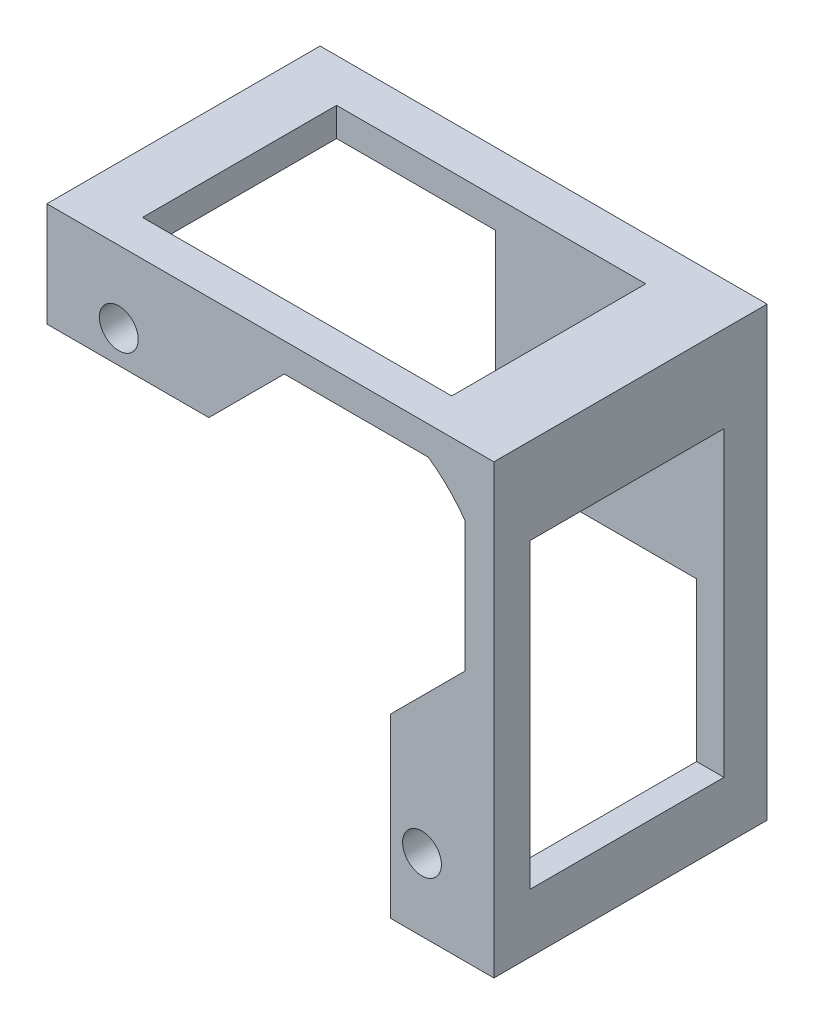
ISO-10303-21;
HEADER;
FILE_DESCRIPTION(('STEP AP214'),'2;1');
FILE_NAME('part.step','',(''),(''),'','','');
FILE_SCHEMA(('AUTOMOTIVE_DESIGN { 1 0 10303 214 1 1 1 1 }'));
ENDSEC;
DATA;
#1=APPLICATION_CONTEXT('core data for automotive mechanical design processes');
#2=APPLICATION_PROTOCOL_DEFINITION('international standard','automotive_design',2000,#1);
#3=PRODUCT_CONTEXT('',#1,'mechanical');
#4=PRODUCT('Part','Part','',(#3));
#5=PRODUCT_RELATED_PRODUCT_CATEGORY('part','',(#4));
#6=PRODUCT_DEFINITION_FORMATION('','',#4);
#7=PRODUCT_DEFINITION_CONTEXT('part definition',#1,'design');
#8=PRODUCT_DEFINITION('design','',#6,#7);
#9=PRODUCT_DEFINITION_SHAPE('','',#8);
#10=(LENGTH_UNIT() NAMED_UNIT(*) SI_UNIT(.MILLI.,.METRE.));
#11=(NAMED_UNIT(*) PLANE_ANGLE_UNIT() SI_UNIT($,.RADIAN.));
#12=(NAMED_UNIT(*) SI_UNIT($,.STERADIAN.) SOLID_ANGLE_UNIT());
#13=UNCERTAINTY_MEASURE_WITH_UNIT(LENGTH_MEASURE(1.E-05),#10,'distance_accuracy_value','');
#14=(GEOMETRIC_REPRESENTATION_CONTEXT(3) GLOBAL_UNCERTAINTY_ASSIGNED_CONTEXT((#13)) GLOBAL_UNIT_ASSIGNED_CONTEXT((#10,
#11,#12)) REPRESENTATION_CONTEXT('',''));
#15=CARTESIAN_POINT('',(0.,0.,0.));
#16=DIRECTION('',(0.,0.,1.));
#17=DIRECTION('',(1.,0.,0.));
#18=AXIS2_PLACEMENT_3D('',#15,#16,#17);
#19=CARTESIAN_POINT('',(117.830929329769,164.974596583901,-421.));
#20=DIRECTION('',(0.,0.,1.));
#21=DIRECTION('',(0.,-1.,0.));
#22=AXIS2_PLACEMENT_3D('',#19,#20,#21);
#23=CYLINDRICAL_SURFACE('',#22,2.7);
#24=CARTESIAN_POINT('',(117.830929329769,164.974596583901,-421.));
#25=DIRECTION('',(0.,0.,1.));
#26=DIRECTION('',(0.,-1.,0.));
#27=AXIS2_PLACEMENT_3D('',#24,#25,#26);
#28=CIRCLE('',#27,2.7);
#29=CARTESIAN_POINT('',(117.830929329769,167.674596583901,-421.));
#30=VERTEX_POINT('',#29);
#31=EDGE_CURVE('E362',#30,#30,#28,.T.);
#32=ORIENTED_EDGE('',*,*,#31,.F.);
#33=DIRECTION('',(0.,0.,1.));
#34=VECTOR('',#33,1.);
#35=CARTESIAN_POINT('',(117.830929329769,167.674596583901,-421.));
#36=LINE('',#35,#34);
#37=CARTESIAN_POINT('',(117.830929329769,167.674596583901,-416.));
#38=VERTEX_POINT('',#37);
#39=EDGE_CURVE('E11',#30,#38,#36,.T.);
#40=ORIENTED_EDGE('',*,*,#39,.T.);
#41=CARTESIAN_POINT('',(117.830929329769,164.974596583901,-416.));
#42=DIRECTION('',(0.,0.,-1.));
#43=DIRECTION('',(0.,-1.,0.));
#44=AXIS2_PLACEMENT_3D('',#41,#42,#43);
#45=CIRCLE('',#44,2.7);
#46=EDGE_CURVE('E532',#38,#38,#45,.T.);
#47=ORIENTED_EDGE('',*,*,#46,.F.);
#48=ORIENTED_EDGE('',*,*,#39,.F.);
#49=EDGE_LOOP('',(#32,#40,#47,#48));
#50=FACE_BOUND('',#49,.T.);
#51=ADVANCED_FACE('F16',(#50),#23,.F.);
#52=CARTESIAN_POINT('',(159.999969673495,122.805556240176,-421.));
#53=DIRECTION('',(0.,0.,1.));
#54=DIRECTION('',(0.,-1.,0.));
#55=AXIS2_PLACEMENT_3D('',#52,#53,#54);
#56=CYLINDRICAL_SURFACE('',#55,2.7);
#57=CARTESIAN_POINT('',(159.999969673495,122.805556240176,-421.));
#58=DIRECTION('',(0.,0.,1.));
#59=DIRECTION('',(0.,-1.,0.));
#60=AXIS2_PLACEMENT_3D('',#57,#58,#59);
#61=CIRCLE('',#60,2.7);
#62=CARTESIAN_POINT('',(159.999969673495,125.505556240176,-421.));
#63=VERTEX_POINT('',#62);
#64=EDGE_CURVE('E336',#63,#63,#61,.T.);
#65=ORIENTED_EDGE('',*,*,#64,.F.);
#66=DIRECTION('',(0.,0.,1.));
#67=VECTOR('',#66,1.);
#68=CARTESIAN_POINT('',(159.999969673495,125.505556240176,-421.));
#69=LINE('',#68,#67);
#70=CARTESIAN_POINT('',(159.999969673495,125.505556240176,-416.));
#71=VERTEX_POINT('',#70);
#72=EDGE_CURVE('E27',#63,#71,#69,.T.);
#73=ORIENTED_EDGE('',*,*,#72,.T.);
#74=CARTESIAN_POINT('',(159.999969673495,122.805556240176,-416.));
#75=DIRECTION('',(0.,0.,-1.));
#76=DIRECTION('',(0.,-1.,0.));
#77=AXIS2_PLACEMENT_3D('',#74,#75,#76);
#78=CIRCLE('',#77,2.7);
#79=EDGE_CURVE('E446',#71,#71,#78,.T.);
#80=ORIENTED_EDGE('',*,*,#79,.F.);
#81=ORIENTED_EDGE('',*,*,#72,.F.);
#82=EDGE_LOOP('',(#65,#73,#80,#81));
#83=FACE_BOUND('',#82,.T.);
#84=ADVANCED_FACE('F657',(#83),#56,.F.);
#85=CARTESIAN_POINT('',(143.062672238361,138.974597314058,-421.));
#86=DIRECTION('',(0.,0.,-1.));
#87=DIRECTION('',(0.,-1.,0.));
#88=AXIS2_PLACEMENT_3D('',#85,#86,#87);
#89=PLANE('',#88);
#90=ORIENTED_EDGE('',*,*,#31,.T.);
#91=EDGE_LOOP('',(#90));
#92=FACE_BOUND('',#91,.T.);
#93=DIRECTION('',(1.,0.,0.));
#94=VECTOR('',#93,1.);
#95=CARTESIAN_POINT('',(135.711309430854,160.478931824688,-421.));
#96=LINE('',#95,#94);
#97=CARTESIAN_POINT('',(107.830929329769,160.478931824688,-421.));
#98=VERTEX_POINT('',#97);
#99=CARTESIAN_POINT('',(130.354281864133,160.478931824688,-421.));
#100=VERTEX_POINT('',#99);
#101=EDGE_CURVE('E369',#98,#100,#96,.T.);
#102=ORIENTED_EDGE('',*,*,#101,.F.);
#103=DIRECTION('',(0.,1.,0.));
#104=VECTOR('',#103,1.);
#105=CARTESIAN_POINT('',(107.830929329769,154.974596583901,-421.));
#106=LINE('',#105,#104);
#107=CARTESIAN_POINT('',(107.830929329769,170.974596583901,-421.));
#108=VERTEX_POINT('',#107);
#109=EDGE_CURVE('E358',#98,#108,#106,.T.);
#110=ORIENTED_EDGE('',*,*,#109,.T.);
#111=DIRECTION('',(-1.,0.,0.));
#112=VECTOR('',#111,1.);
#113=CARTESIAN_POINT('',(125.446800784065,170.974596583901,-421.));
#114=LINE('',#113,#112);
#115=CARTESIAN_POINT('',(116.125374803227,170.974596583901,-421.000004917383));
#116=VERTEX_POINT('',#115);
#117=EDGE_CURVE('E461',#116,#108,#114,.T.);
#118=ORIENTED_EDGE('',*,*,#117,.F.);
#119=DIRECTION('',(0.,1.,0.));
#120=VECTOR('',#119,1.);
#121=CARTESIAN_POINT('',(116.125374803227,174.974596583901,-421.000004917383));
#122=LINE('',#121,#120);
#123=CARTESIAN_POINT('',(116.125374803227,174.974596583901,-421.000004917383));
#124=VERTEX_POINT('',#123);
#125=EDGE_CURVE('E428',#116,#124,#122,.T.);
#126=ORIENTED_EDGE('',*,*,#125,.T.);
#127=DIRECTION('',(1.,0.,0.));
#128=VECTOR('',#127,1.);
#129=CARTESIAN_POINT('',(116.125374803227,174.974596583901,-421.000004917383));
#130=LINE('',#129,#128);
#131=CARTESIAN_POINT('',(159.125375443977,174.974596583901,-421.000004917383));
#132=VERTEX_POINT('',#131);
#133=EDGE_CURVE('E357',#124,#132,#130,.T.);
#134=ORIENTED_EDGE('',*,*,#133,.T.);
#135=DIRECTION('',(0.,-1.,0.));
#136=VECTOR('',#135,1.);
#137=CARTESIAN_POINT('',(159.125375443977,174.974596583901,-421.000004917383));
#138=LINE('',#137,#136);
#139=CARTESIAN_POINT('',(159.125375443977,172.083609871223,-421.000004917383));
#140=VERTEX_POINT('',#139);
#141=EDGE_CURVE('E213',#132,#140,#138,.T.);
#142=ORIENTED_EDGE('',*,*,#141,.T.);
#143=CARTESIAN_POINT('',(148.821478068075,153.796104978481,-421.));
#144=DIRECTION('',(0.,0.,-1.));
#145=DIRECTION('',(0.,-1.,0.));
#146=AXIS2_PLACEMENT_3D('',#143,#144,#145);
#147=CIRCLE('',#146,20.9905487383057);
#148=CARTESIAN_POINT('',(160.88392236837,170.974596583901,-421.));
#149=VERTEX_POINT('',#148);
#150=EDGE_CURVE('E399',#140,#149,#147,.T.);
#151=ORIENTED_EDGE('',*,*,#150,.T.);
#152=DIRECTION('',(1.,0.,0.));
#153=VECTOR('',#152,1.);
#154=CARTESIAN_POINT('',(107.830929329769,170.974596583901,-421.));
#155=LINE('',#154,#153);
#156=CARTESIAN_POINT('',(140.849946623346,170.974596583901,-421.));
#157=VERTEX_POINT('',#156);
#158=EDGE_CURVE('E363',#157,#149,#155,.T.);
#159=ORIENTED_EDGE('',*,*,#158,.F.);
#160=DIRECTION('',(-0.707106781186547,-0.707106781186548,0.));
#161=VECTOR('',#160,1.);
#162=CARTESIAN_POINT('',(130.280628209639,160.405278170194,-421.));
#163=LINE('',#162,#161);
#164=EDGE_CURVE('E356',#157,#100,#163,.T.);
#165=ORIENTED_EDGE('',*,*,#164,.T.);
#166=EDGE_LOOP('',(#102,#110,#118,#126,#134,#142,#151,#159,#165));
#167=FACE_BOUND('',#166,.T.);
#168=ADVANCED_FACE('F662',(#92,#167),#89,.T.);
#169=CARTESIAN_POINT('',(107.830929329769,174.974596583901,-421.));
#170=DIRECTION('',(-1.,0.,0.));
#171=DIRECTION('',(0.,0.,1.));
#172=AXIS2_PLACEMENT_3D('',#169,#170,#171);
#173=PLANE('',#172);
#174=ORIENTED_EDGE('',*,*,#109,.F.);
#175=DIRECTION('',(0.,0.,1.));
#176=VECTOR('',#175,1.);
#177=CARTESIAN_POINT('',(107.830929329769,160.478931824688,-418.5));
#178=LINE('',#177,#176);
#179=CARTESIAN_POINT('',(107.830929329769,160.478931824688,-416.));
#180=VERTEX_POINT('',#179);
#181=EDGE_CURVE('E372',#98,#180,#178,.T.);
#182=ORIENTED_EDGE('',*,*,#181,.T.);
#183=DIRECTION('',(0.,-1.,0.));
#184=VECTOR('',#183,1.);
#185=CARTESIAN_POINT('',(107.830929329769,160.978931824688,-416.));
#186=LINE('',#185,#184);
#187=CARTESIAN_POINT('',(107.830929329769,174.974596583901,-416.));
#188=VERTEX_POINT('',#187);
#189=EDGE_CURVE('E309',#188,#180,#186,.T.);
#190=ORIENTED_EDGE('',*,*,#189,.F.);
#191=DIRECTION('',(0.,0.,1.));
#192=VECTOR('',#191,1.);
#193=CARTESIAN_POINT('',(107.830929329769,174.974596583901,-418.5));
#194=LINE('',#193,#192);
#195=CARTESIAN_POINT('',(107.830929329769,174.974596583901,-454.));
#196=VERTEX_POINT('',#195);
#197=EDGE_CURVE('E325',#196,#188,#194,.T.);
#198=ORIENTED_EDGE('',*,*,#197,.F.);
#199=DIRECTION('',(0.,-1.,0.));
#200=VECTOR('',#199,1.);
#201=CARTESIAN_POINT('',(107.830929329769,174.974596583901,-454.));
#202=LINE('',#201,#200);
#203=CARTESIAN_POINT('',(107.830929329769,170.974596583901,-454.));
#204=VERTEX_POINT('',#203);
#205=EDGE_CURVE('E337',#196,#204,#202,.T.);
#206=ORIENTED_EDGE('',*,*,#205,.T.);
#207=DIRECTION('',(0.,0.,-1.));
#208=VECTOR('',#207,1.);
#209=CARTESIAN_POINT('',(107.830929329769,170.974596583901,-421.));
#210=LINE('',#209,#208);
#211=EDGE_CURVE('E465',#108,#204,#210,.T.);
#212=ORIENTED_EDGE('',*,*,#211,.F.);
#213=EDGE_LOOP('',(#174,#182,#190,#198,#206,#212));
#214=FACE_BOUND('',#213,.T.);
#215=ADVANCED_FACE('F667',(#214),#173,.T.);
#216=CARTESIAN_POINT('',(165.999969673495,132.934964665105,-416.));
#217=DIRECTION('',(-1.,0.,0.));
#218=DIRECTION('',(0.,0.,1.));
#219=AXIS2_PLACEMENT_3D('',#216,#217,#218);
#220=PLANE('',#219);
#221=DIRECTION('',(0.,0.,1.));
#222=VECTOR('',#221,1.);
#223=CARTESIAN_POINT('',(165.999969673495,147.784964665105,-416.));
#224=LINE('',#223,#222);
#225=CARTESIAN_POINT('',(165.999969673495,147.784964665105,-421.));
#226=VERTEX_POINT('',#225);
#227=CARTESIAN_POINT('',(165.999969673495,147.784964665105,-416.));
#228=VERTEX_POINT('',#227);
#229=EDGE_CURVE('E547',#226,#228,#224,.T.);
#230=ORIENTED_EDGE('',*,*,#229,.T.);
#231=DIRECTION('',(0.,1.,0.));
#232=VECTOR('',#231,1.);
#233=CARTESIAN_POINT('',(165.999969673495,112.805556240176,-416.));
#234=LINE('',#233,#232);
#235=CARTESIAN_POINT('',(165.999969673495,165.858549278776,-416.));
#236=VERTEX_POINT('',#235);
#237=EDGE_CURVE('E346',#228,#236,#234,.T.);
#238=ORIENTED_EDGE('',*,*,#237,.T.);
#239=DIRECTION('',(0.,0.,-1.));
#240=VECTOR('',#239,1.);
#241=CARTESIAN_POINT('',(165.999969673495,165.858549278776,-454.));
#242=LINE('',#241,#240);
#243=CARTESIAN_POINT('',(165.999969673495,165.858549278776,-421.));
#244=VERTEX_POINT('',#243);
#245=EDGE_CURVE('E364',#236,#244,#242,.T.);
#246=ORIENTED_EDGE('',*,*,#245,.T.);
#247=DIRECTION('',(0.,-1.,0.));
#248=VECTOR('',#247,1.);
#249=CARTESIAN_POINT('',(165.999969673495,135.954780989581,-421.));
#250=LINE('',#249,#248);
#251=EDGE_CURVE('E331',#244,#226,#250,.T.);
#252=ORIENTED_EDGE('',*,*,#251,.T.);
#253=EDGE_LOOP('',(#230,#238,#246,#252));
#254=FACE_BOUND('',#253,.T.);
#255=ADVANCED_FACE('F626',(#254),#220,.T.);
#256=CARTESIAN_POINT('',(169.999969673495,120.974598312436,-425.000004902482));
#257=DIRECTION('',(0.,1.,0.));
#258=DIRECTION('',(1.,0.,0.));
#259=AXIS2_PLACEMENT_3D('',#256,#257,#258);
#260=PLANE('',#259);
#261=DIRECTION('',(1.,0.,0.));
#262=VECTOR('',#261,1.);
#263=CARTESIAN_POINT('',(159.410723870785,120.974598312436,-448.));
#264=LINE('',#263,#262);
#265=CARTESIAN_POINT('',(166.196900933288,120.974598312436,-448.000005155802));
#266=VERTEX_POINT('',#265);
#267=CARTESIAN_POINT('',(169.999969673495,120.974598312436,-448.000005155802));
#268=VERTEX_POINT('',#267);
#269=EDGE_CURVE('E392',#266,#268,#264,.T.);
#270=ORIENTED_EDGE('',*,*,#269,.F.);
#271=DIRECTION('',(0.,0.,1.));
#272=VECTOR('',#271,1.);
#273=CARTESIAN_POINT('',(166.196900933288,120.974598312436,-431.500002577901));
#274=LINE('',#273,#272);
#275=CARTESIAN_POINT('',(166.196900933288,120.974598312436,-421.000004902482));
#276=VERTEX_POINT('',#275);
#277=EDGE_CURVE('E434',#266,#276,#274,.T.);
#278=ORIENTED_EDGE('',*,*,#277,.T.);
#279=DIRECTION('',(-1.,0.,0.));
#280=VECTOR('',#279,1.);
#281=CARTESIAN_POINT('',(169.999969673495,120.974598312436,-421.000004902482));
#282=LINE('',#281,#280);
#283=CARTESIAN_POINT('',(169.999969673495,120.974598312436,-421.000004902482));
#284=VERTEX_POINT('',#283);
#285=EDGE_CURVE('E352',#284,#276,#282,.T.);
#286=ORIENTED_EDGE('',*,*,#285,.F.);
#287=DIRECTION('',(0.,0.,-1.));
#288=VECTOR('',#287,1.);
#289=CARTESIAN_POINT('',(169.999969673495,120.974598312436,-429.000002577901));
#290=LINE('',#289,#288);
#291=EDGE_CURVE('E514',#284,#268,#290,.T.);
#292=ORIENTED_EDGE('',*,*,#291,.T.);
#293=EDGE_LOOP('',(#270,#278,#286,#292));
#294=FACE_BOUND('',#293,.T.);
#295=ADVANCED_FACE('F1015',(#294),#260,.T.);
#296=CARTESIAN_POINT('',(107.830929329769,170.974596583901,-421.));
#297=DIRECTION('',(0.,1.,0.));
#298=DIRECTION('',(1.,0.,0.));
#299=AXIS2_PLACEMENT_3D('',#296,#297,#298);
#300=PLANE('',#299);
#301=DIRECTION('',(0.,0.,-1.));
#302=VECTOR('',#301,1.);
#303=CARTESIAN_POINT('',(140.849946623346,170.974596583901,-418.5));
#304=LINE('',#303,#302);
#305=CARTESIAN_POINT('',(140.849946623346,170.974596583901,-416.));
#306=VERTEX_POINT('',#305);
#307=EDGE_CURVE('E373',#306,#157,#304,.T.);
#308=ORIENTED_EDGE('',*,*,#307,.T.);
#309=ORIENTED_EDGE('',*,*,#158,.T.);
#310=DIRECTION('',(0.,0.,1.));
#311=VECTOR('',#310,1.);
#312=CARTESIAN_POINT('',(160.88392236837,170.974596583901,-454.));
#313=LINE('',#312,#311);
#314=CARTESIAN_POINT('',(160.88392236837,170.974596583901,-416.));
#315=VERTEX_POINT('',#314);
#316=EDGE_CURVE('E368',#149,#315,#313,.T.);
#317=ORIENTED_EDGE('',*,*,#316,.T.);
#318=DIRECTION('',(1.,0.,0.));
#319=VECTOR('',#318,1.);
#320=CARTESIAN_POINT('',(107.830929329769,170.974596583901,-416.));
#321=LINE('',#320,#319);
#322=EDGE_CURVE('E347',#306,#315,#321,.T.);
#323=ORIENTED_EDGE('',*,*,#322,.F.);
#324=EDGE_LOOP('',(#308,#309,#317,#323));
#325=FACE_BOUND('',#324,.T.);
#326=ADVANCED_FACE('F956',(#325),#300,.F.);
#327=CARTESIAN_POINT('',(158.574969673495,140.359964665105,-416.));
#328=DIRECTION('',(0.707106781186547,-0.707106781186548,0.));
#329=DIRECTION('',(0.,0.,-1.));
#330=AXIS2_PLACEMENT_3D('',#327,#328,#329);
#331=PLANE('',#330);
#332=DIRECTION('',(0.,0.,-1.));
#333=VECTOR('',#332,1.);
#334=CARTESIAN_POINT('',(155.648699836796,137.433694828406,-418.5));
#335=LINE('',#334,#333);
#336=CARTESIAN_POINT('',(155.648699836796,137.433694828406,-416.));
#337=VERTEX_POINT('',#336);
#338=CARTESIAN_POINT('',(155.648699836796,137.433694828406,-421.));
#339=VERTEX_POINT('',#338);
#340=EDGE_CURVE('E335',#337,#339,#335,.T.);
#341=ORIENTED_EDGE('',*,*,#340,.F.);
#342=DIRECTION('',(-0.707106781186548,-0.707106781186547,0.));
#343=VECTOR('',#342,1.);
#344=CARTESIAN_POINT('',(154.35055347695,136.13554846856,-416.));
#345=LINE('',#344,#343);
#346=EDGE_CURVE('E316',#228,#337,#345,.T.);
#347=ORIENTED_EDGE('',*,*,#346,.F.);
#348=ORIENTED_EDGE('',*,*,#229,.F.);
#349=DIRECTION('',(0.707106781186548,0.707106781186547,0.));
#350=VECTOR('',#349,1.);
#351=CARTESIAN_POINT('',(154.35055347695,136.13554846856,-421.));
#352=LINE('',#351,#350);
#353=EDGE_CURVE('E480',#339,#226,#352,.T.);
#354=ORIENTED_EDGE('',*,*,#353,.F.);
#355=EDGE_LOOP('',(#341,#347,#348,#354));
#356=FACE_BOUND('',#355,.T.);
#357=ADVANCED_FACE('F617',(#356),#331,.F.);
#358=CARTESIAN_POINT('',(169.999969673495,174.974596583901,-416.));
#359=DIRECTION('',(1.,0.,0.));
#360=DIRECTION('',(0.,-1.,0.));
#361=AXIS2_PLACEMENT_3D('',#358,#359,#360);
#362=PLANE('',#361);
#363=ORIENTED_EDGE('',*,*,#291,.F.);
#364=DIRECTION('',(0.,-1.,0.));
#365=VECTOR('',#364,1.);
#366=CARTESIAN_POINT('',(169.999969673495,168.974597761093,-421.000004902482));
#367=LINE('',#366,#365);
#368=CARTESIAN_POINT('',(169.999969673495,162.974598938285,-421.000004902482));
#369=VERTEX_POINT('',#368);
#370=EDGE_CURVE('E348',#369,#284,#367,.T.);
#371=ORIENTED_EDGE('',*,*,#370,.F.);
#372=DIRECTION('',(0.,0.,1.));
#373=VECTOR('',#372,1.);
#374=CARTESIAN_POINT('',(169.999969673495,162.974598938285,-429.000002577901));
#375=LINE('',#374,#373);
#376=CARTESIAN_POINT('',(169.999969673495,162.974598938285,-448.000005155802));
#377=VERTEX_POINT('',#376);
#378=EDGE_CURVE('E429',#377,#369,#375,.T.);
#379=ORIENTED_EDGE('',*,*,#378,.F.);
#380=DIRECTION('',(0.,-1.,0.));
#381=VECTOR('',#380,1.);
#382=CARTESIAN_POINT('',(169.999969673495,147.974597448168,-448.000005155802));
#383=LINE('',#382,#381);
#384=EDGE_CURVE('E396',#377,#268,#383,.T.);
#385=ORIENTED_EDGE('',*,*,#384,.T.);
#386=EDGE_LOOP('',(#363,#371,#379,#385));
#387=FACE_BOUND('',#386,.T.);
#388=DIRECTION('',(0.,1.,0.));
#389=VECTOR('',#388,1.);
#390=CARTESIAN_POINT('',(169.999969673495,112.805556240176,-454.));
#391=LINE('',#390,#389);
#392=CARTESIAN_POINT('',(169.999969673495,112.805556240176,-454.));
#393=VERTEX_POINT('',#392);
#394=CARTESIAN_POINT('',(169.999969673495,174.974596583901,-454.));
#395=VERTEX_POINT('',#394);
#396=EDGE_CURVE('E418',#393,#395,#391,.T.);
#397=ORIENTED_EDGE('',*,*,#396,.T.);
#398=DIRECTION('',(0.,0.,-1.));
#399=VECTOR('',#398,1.);
#400=CARTESIAN_POINT('',(169.999969673495,174.974596583901,-416.));
#401=LINE('',#400,#399);
#402=CARTESIAN_POINT('',(169.999969673495,174.974596583901,-416.));
#403=VERTEX_POINT('',#402);
#404=EDGE_CURVE('E321',#403,#395,#401,.T.);
#405=ORIENTED_EDGE('',*,*,#404,.F.);
#406=DIRECTION('',(0.,-1.,0.));
#407=VECTOR('',#406,1.);
#408=CARTESIAN_POINT('',(169.999969673495,174.974596583901,-416.));
#409=LINE('',#408,#407);
#410=CARTESIAN_POINT('',(169.999969673495,112.805556240176,-416.));
#411=VERTEX_POINT('',#410);
#412=EDGE_CURVE('E407',#403,#411,#409,.T.);
#413=ORIENTED_EDGE('',*,*,#412,.T.);
#414=DIRECTION('',(0.,0.,-1.));
#415=VECTOR('',#414,1.);
#416=CARTESIAN_POINT('',(169.999969673495,112.805556240176,-418.5));
#417=LINE('',#416,#415);
#418=EDGE_CURVE('E439',#411,#393,#417,.T.);
#419=ORIENTED_EDGE('',*,*,#418,.T.);
#420=EDGE_LOOP('',(#397,#405,#413,#419));
#421=FACE_BOUND('',#420,.T.);
#422=ADVANCED_FACE('F18',(#387,#421),#362,.T.);
#423=CARTESIAN_POINT('',(116.125374803227,174.974596583901,-443.000005170703));
#424=DIRECTION('',(1.,0.,0.));
#425=DIRECTION('',(0.,-1.,0.));
#426=AXIS2_PLACEMENT_3D('',#423,#424,#425);
#427=PLANE('',#426);
#428=DIRECTION('',(0.,-1.,0.));
#429=VECTOR('',#428,1.);
#430=CARTESIAN_POINT('',(116.125374803227,164.385350781191,-448.));
#431=LINE('',#430,#429);
#432=CARTESIAN_POINT('',(116.125374803227,174.974596583901,-448.000005170703));
#433=VERTEX_POINT('',#432);
#434=CARTESIAN_POINT('',(116.125374803227,170.974596583901,-448.000005170703));
#435=VERTEX_POINT('',#434);
#436=EDGE_CURVE('E507',#433,#435,#431,.T.);
#437=ORIENTED_EDGE('',*,*,#436,.F.);
#438=DIRECTION('',(0.,0.,1.));
#439=VECTOR('',#438,1.);
#440=CARTESIAN_POINT('',(116.125374803227,174.974596583901,-421.000002458692));
#441=LINE('',#440,#439);
#442=EDGE_CURVE('E324',#433,#124,#441,.T.);
#443=ORIENTED_EDGE('',*,*,#442,.T.);
#444=ORIENTED_EDGE('',*,*,#125,.F.);
#445=DIRECTION('',(0.,0.,-1.));
#446=VECTOR('',#445,1.);
#447=CARTESIAN_POINT('',(116.125374803227,170.974596583901,-423.500002458692));
#448=LINE('',#447,#446);
#449=EDGE_CURVE('E304',#116,#435,#448,.T.);
#450=ORIENTED_EDGE('',*,*,#449,.T.);
#451=EDGE_LOOP('',(#437,#443,#444,#450));
#452=FACE_BOUND('',#451,.T.);
#453=ADVANCED_FACE('F943',(#452),#427,.T.);
#454=CARTESIAN_POINT('',(159.125375443977,174.974596583901,-426.000004917383));
#455=DIRECTION('',(-1.,0.,0.));
#456=DIRECTION('',(0.,0.,1.));
#457=AXIS2_PLACEMENT_3D('',#454,#455,#456);
#458=PLANE('',#457);
#459=DIRECTION('',(0.,1.,0.));
#460=VECTOR('',#459,1.);
#461=CARTESIAN_POINT('',(159.125375443977,164.385350781191,-448.));
#462=LINE('',#461,#460);
#463=CARTESIAN_POINT('',(159.125375443977,172.083609871223,-448.000005170703));
#464=VERTEX_POINT('',#463);
#465=CARTESIAN_POINT('',(159.125375443977,174.974596583901,-448.000005170703));
#466=VERTEX_POINT('',#465);
#467=EDGE_CURVE('E224',#464,#466,#462,.T.);
#468=ORIENTED_EDGE('',*,*,#467,.F.);
#469=DIRECTION('',(0.,0.,1.));
#470=VECTOR('',#469,1.);
#471=CARTESIAN_POINT('',(159.125375443977,172.083609871223,-454.));
#472=LINE('',#471,#470);
#473=EDGE_CURVE('E168',#464,#140,#472,.T.);
#474=ORIENTED_EDGE('',*,*,#473,.T.);
#475=ORIENTED_EDGE('',*,*,#141,.F.);
#476=DIRECTION('',(0.,0.,-1.));
#477=VECTOR('',#476,1.);
#478=CARTESIAN_POINT('',(159.125375443977,174.974596583901,-421.000002458692));
#479=LINE('',#478,#477);
#480=EDGE_CURVE('E453',#132,#466,#479,.T.);
#481=ORIENTED_EDGE('',*,*,#480,.T.);
#482=EDGE_LOOP('',(#468,#474,#475,#481));
#483=FACE_BOUND('',#482,.T.);
#484=ADVANCED_FACE('F968',(#483),#458,.T.);
#485=CARTESIAN_POINT('',(169.999969673495,162.974598938285,-442.000005155802));
#486=DIRECTION('',(0.,-1.,0.));
#487=DIRECTION('',(-1.,0.,0.));
#488=AXIS2_PLACEMENT_3D('',#485,#486,#487);
#489=PLANE('',#488);
#490=DIRECTION('',(-1.,0.,0.));
#491=VECTOR('',#490,1.);
#492=CARTESIAN_POINT('',(159.410723870785,162.974598938285,-448.));
#493=LINE('',#492,#491);
#494=CARTESIAN_POINT('',(167.698935125768,162.974598938285,-448.000005155802));
#495=VERTEX_POINT('',#494);
#496=EDGE_CURVE('E457',#377,#495,#493,.T.);
#497=ORIENTED_EDGE('',*,*,#496,.F.);
#498=ORIENTED_EDGE('',*,*,#378,.T.);
#499=DIRECTION('',(1.,0.,0.));
#500=VECTOR('',#499,1.);
#501=CARTESIAN_POINT('',(169.999969673495,162.974598938285,-421.000004902482));
#502=LINE('',#501,#500);
#503=CARTESIAN_POINT('',(167.698935125768,162.974598938285,-421.000004902482));
#504=VERTEX_POINT('',#503);
#505=EDGE_CURVE('E330',#504,#369,#502,.T.);
#506=ORIENTED_EDGE('',*,*,#505,.F.);
#507=DIRECTION('',(0.,0.,-1.));
#508=VECTOR('',#507,1.);
#509=CARTESIAN_POINT('',(167.698935125768,162.974598938285,-454.));
#510=LINE('',#509,#508);
#511=EDGE_CURVE('E182',#504,#495,#510,.T.);
#512=ORIENTED_EDGE('',*,*,#511,.T.);
#513=EDGE_LOOP('',(#497,#498,#506,#512));
#514=FACE_BOUND('',#513,.T.);
#515=ADVANCED_FACE('F972',(#514),#489,.T.);
#516=CARTESIAN_POINT('',(148.821478068075,153.796104978481,-454.));
#517=DIRECTION('',(0.,0.,-1.));
#518=DIRECTION('',(0.,-1.,0.));
#519=AXIS2_PLACEMENT_3D('',#516,#517,#518);
#520=CYLINDRICAL_SURFACE('',#519,20.9905487383057);
#521=ORIENTED_EDGE('',*,*,#511,.F.);
#522=CARTESIAN_POINT('',(148.821478068075,153.796104978481,-421.));
#523=DIRECTION('',(0.,0.,-1.));
#524=DIRECTION('',(0.,-1.,0.));
#525=AXIS2_PLACEMENT_3D('',#522,#523,#524);
#526=CIRCLE('',#525,20.9905487383057);
#527=EDGE_CURVE('E326',#244,#504,#526,.T.);
#528=ORIENTED_EDGE('',*,*,#527,.F.);
#529=ORIENTED_EDGE('',*,*,#245,.F.);
#530=CARTESIAN_POINT('',(148.821478068075,153.796104978481,-416.));
#531=DIRECTION('',(0.,0.,1.));
#532=DIRECTION('',(0.,-1.,0.));
#533=AXIS2_PLACEMENT_3D('',#530,#531,#532);
#534=CIRCLE('',#533,20.9905487383057);
#535=EDGE_CURVE('E342',#236,#315,#534,.T.);
#536=ORIENTED_EDGE('',*,*,#535,.T.);
#537=ORIENTED_EDGE('',*,*,#316,.F.);
#538=ORIENTED_EDGE('',*,*,#150,.F.);
#539=ORIENTED_EDGE('',*,*,#473,.F.);
#540=CARTESIAN_POINT('',(148.821478068075,153.796104978481,-448.));
#541=DIRECTION('',(0.,0.,1.));
#542=DIRECTION('',(0.,-1.,0.));
#543=AXIS2_PLACEMENT_3D('',#540,#541,#542);
#544=CIRCLE('',#543,20.9905487383057);
#545=EDGE_CURVE('E454',#495,#464,#544,.T.);
#546=ORIENTED_EDGE('',*,*,#545,.F.);
#547=EDGE_LOOP('',(#521,#528,#529,#536,#537,#538,#539,#546));
#548=FACE_BOUND('',#547,.T.);
#549=ADVANCED_FACE('F630',(#548),#520,.F.);
#550=CARTESIAN_POINT('',(136.759033767781,142.974101259783,-454.));
#551=DIRECTION('',(0.,-1.,0.));
#552=DIRECTION('',(-1.,0.,0.));
#553=AXIS2_PLACEMENT_3D('',#550,#551,#552);
#554=PLANE('',#553);
#555=DIRECTION('',(0.,0.,-1.));
#556=VECTOR('',#555,1.);
#557=CARTESIAN_POINT('',(143.197033767781,142.974101259783,-454.));
#558=LINE('',#557,#556);
#559=CARTESIAN_POINT('',(143.197033767781,142.974101259783,-448.));
#560=VERTEX_POINT('',#559);
#561=CARTESIAN_POINT('',(143.197033767781,142.974101259783,-454.));
#562=VERTEX_POINT('',#561);
#563=EDGE_CURVE('E267',#560,#562,#558,.T.);
#564=ORIENTED_EDGE('',*,*,#563,.T.);
#565=DIRECTION('',(1.,0.,0.));
#566=VECTOR('',#565,1.);
#567=CARTESIAN_POINT('',(142.790255917928,142.974101259783,-454.));
#568=LINE('',#567,#566);
#569=CARTESIAN_POINT('',(166.196900933288,142.974101259783,-454.));
#570=VERTEX_POINT('',#569);
#571=EDGE_CURVE('E271',#562,#570,#568,.T.);
#572=ORIENTED_EDGE('',*,*,#571,.T.);
#573=DIRECTION('',(0.,0.,1.));
#574=VECTOR('',#573,1.);
#575=CARTESIAN_POINT('',(166.196900933288,142.974101259783,-421.));
#576=LINE('',#575,#574);
#577=CARTESIAN_POINT('',(166.196900933288,142.974101259783,-448.));
#578=VERTEX_POINT('',#577);
#579=EDGE_CURVE('E261',#570,#578,#576,.T.);
#580=ORIENTED_EDGE('',*,*,#579,.T.);
#581=DIRECTION('',(-1.,0.,0.));
#582=VECTOR('',#581,1.);
#583=CARTESIAN_POINT('',(142.790255917928,142.974101259783,-448.));
#584=LINE('',#583,#582);
#585=EDGE_CURVE('E274',#578,#560,#584,.T.);
#586=ORIENTED_EDGE('',*,*,#585,.T.);
#587=EDGE_LOOP('',(#564,#572,#580,#586));
#588=FACE_BOUND('',#587,.T.);
#589=ADVANCED_FACE('F269',(#588),#554,.T.);
#590=CARTESIAN_POINT('',(138.197033767781,170.974596583901,-454.));
#591=DIRECTION('',(-1.,0.,0.));
#592=DIRECTION('',(0.,0.,1.));
#593=AXIS2_PLACEMENT_3D('',#590,#591,#592);
#594=PLANE('',#593);
#595=DIRECTION('',(0.,0.,1.));
#596=VECTOR('',#595,1.);
#597=CARTESIAN_POINT('',(138.197033767781,147.974101259783,-454.));
#598=LINE('',#597,#596);
#599=CARTESIAN_POINT('',(138.197033767781,147.974101259783,-454.));
#600=VERTEX_POINT('',#599);
#601=CARTESIAN_POINT('',(138.197033767781,147.974101259783,-448.));
#602=VERTEX_POINT('',#601);
#603=EDGE_CURVE('E20',#600,#602,#598,.T.);
#604=ORIENTED_EDGE('',*,*,#603,.T.);
#605=DIRECTION('',(0.,1.,0.));
#606=VECTOR('',#605,1.);
#607=CARTESIAN_POINT('',(138.197033767781,162.385350781191,-448.));
#608=LINE('',#607,#606);
#609=CARTESIAN_POINT('',(138.197033767781,170.974596583901,-448.));
#610=VERTEX_POINT('',#609);
#611=EDGE_CURVE('E506',#602,#610,#608,.T.);
#612=ORIENTED_EDGE('',*,*,#611,.T.);
#613=DIRECTION('',(0.,0.,-1.));
#614=VECTOR('',#613,1.);
#615=CARTESIAN_POINT('',(138.197033767781,170.974596583901,-449.));
#616=LINE('',#615,#614);
#617=CARTESIAN_POINT('',(138.197033767781,170.974596583901,-454.));
#618=VERTEX_POINT('',#617);
#619=EDGE_CURVE('E555',#610,#618,#616,.T.);
#620=ORIENTED_EDGE('',*,*,#619,.T.);
#621=DIRECTION('',(0.,-1.,0.));
#622=VECTOR('',#621,1.);
#623=CARTESIAN_POINT('',(138.197033767781,162.385350781191,-454.));
#624=LINE('',#623,#622);
#625=EDGE_CURVE('E288',#618,#600,#624,.T.);
#626=ORIENTED_EDGE('',*,*,#625,.T.);
#627=EDGE_LOOP('',(#604,#612,#620,#626));
#628=FACE_BOUND('',#627,.T.);
#629=ADVANCED_FACE('F683',(#628),#594,.T.);
#630=CARTESIAN_POINT('',(148.821478068075,153.796104978481,-448.));
#631=DIRECTION('',(0.,0.,1.));
#632=DIRECTION('',(1.,0.,0.));
#633=AXIS2_PLACEMENT_3D('',#630,#631,#632);
#634=PLANE('',#633);
#635=CARTESIAN_POINT('',(148.821478068075,153.796104978481,-448.));
#636=DIRECTION('',(0.,0.,1.));
#637=DIRECTION('',(0.,1.,0.));
#638=AXIS2_PLACEMENT_3D('',#635,#636,#637);
#639=CIRCLE('',#638,2.55);
#640=CARTESIAN_POINT('',(148.821478068075,151.246104978481,-448.));
#641=VERTEX_POINT('',#640);
#642=EDGE_CURVE('E531',#641,#641,#639,.T.);
#643=ORIENTED_EDGE('',*,*,#642,.F.);
#644=EDGE_LOOP('',(#643));
#645=FACE_BOUND('',#644,.T.);
#646=DIRECTION('',(0.707106781186547,-0.707106781186548,0.));
#647=VECTOR('',#646,1.);
#648=CARTESIAN_POINT('',(140.64764391318,145.523491114384,-448.));
#649=LINE('',#648,#647);
#650=EDGE_CURVE('E488',#602,#560,#649,.T.);
#651=ORIENTED_EDGE('',*,*,#650,.T.);
#652=ORIENTED_EDGE('',*,*,#585,.F.);
#653=DIRECTION('',(0.,1.,0.));
#654=VECTOR('',#653,1.);
#655=CARTESIAN_POINT('',(166.196900933288,147.907603119132,-448.));
#656=LINE('',#655,#654);
#657=CARTESIAN_POINT('',(166.196900933288,142.019101259783,-448.));
#658=VERTEX_POINT('',#657);
#659=EDGE_CURVE('E320',#658,#578,#656,.T.);
#660=ORIENTED_EDGE('',*,*,#659,.F.);
#661=DIRECTION('',(0.,1.,0.));
#662=VECTOR('',#661,1.);
#663=CARTESIAN_POINT('',(166.196900933288,131.49684978611,-448.000005155802));
#664=LINE('',#663,#662);
#665=EDGE_CURVE('E430',#266,#658,#664,.T.);
#666=ORIENTED_EDGE('',*,*,#665,.F.);
#667=ORIENTED_EDGE('',*,*,#269,.T.);
#668=ORIENTED_EDGE('',*,*,#384,.F.);
#669=ORIENTED_EDGE('',*,*,#496,.T.);
#670=ORIENTED_EDGE('',*,*,#545,.T.);
#671=ORIENTED_EDGE('',*,*,#467,.T.);
#672=DIRECTION('',(1.,0.,0.));
#673=VECTOR('',#672,1.);
#674=CARTESIAN_POINT('',(137.625375123602,174.974596583901,-448.000005170703));
#675=LINE('',#674,#673);
#676=EDGE_CURVE('E411',#433,#466,#675,.T.);
#677=ORIENTED_EDGE('',*,*,#676,.F.);
#678=ORIENTED_EDGE('',*,*,#436,.T.);
#679=DIRECTION('',(-1.,0.,0.));
#680=VECTOR('',#679,1.);
#681=CARTESIAN_POINT('',(133.478152386873,170.974596583901,-448.000005170703));
#682=LINE('',#681,#680);
#683=CARTESIAN_POINT('',(136.759033767781,170.974596583901,-448.));
#684=VERTEX_POINT('',#683);
#685=EDGE_CURVE('E419',#684,#435,#682,.T.);
#686=ORIENTED_EDGE('',*,*,#685,.F.);
#687=DIRECTION('',(-1.,0.,0.));
#688=VECTOR('',#687,1.);
#689=CARTESIAN_POINT('',(142.790255917928,170.974596583901,-448.));
#690=LINE('',#689,#688);
#691=EDGE_CURVE('E423',#610,#684,#690,.T.);
#692=ORIENTED_EDGE('',*,*,#691,.F.);
#693=ORIENTED_EDGE('',*,*,#611,.F.);
#694=EDGE_LOOP('',(#651,#652,#660,#666,#667,#668,#669,#670,#671,#677,#678,#686,#692,#693));
#695=FACE_BOUND('',#694,.T.);
#696=ADVANCED_FACE('F681',(#645,#695),#634,.T.);
#697=CARTESIAN_POINT('',(140.697033767781,145.474101259783,-454.));
#698=DIRECTION('',(0.707106781186548,0.707106781186547,0.));
#699=DIRECTION('',(0.,0.,-1.));
#700=AXIS2_PLACEMENT_3D('',#697,#698,#699);
#701=PLANE('',#700);
#702=ORIENTED_EDGE('',*,*,#650,.F.);
#703=ORIENTED_EDGE('',*,*,#603,.F.);
#704=DIRECTION('',(-0.707106781186547,0.707106781186548,0.));
#705=VECTOR('',#704,1.);
#706=CARTESIAN_POINT('',(140.64764391318,145.523491114384,-454.));
#707=LINE('',#706,#705);
#708=EDGE_CURVE('E281',#562,#600,#707,.T.);
#709=ORIENTED_EDGE('',*,*,#708,.F.);
#710=ORIENTED_EDGE('',*,*,#563,.F.);
#711=EDGE_LOOP('',(#702,#703,#709,#710));
#712=FACE_BOUND('',#711,.T.);
#713=ADVANCED_FACE('F282',(#712),#701,.F.);
#714=CARTESIAN_POINT('',(169.999969673495,112.805556240176,-421.));
#715=DIRECTION('',(0.,1.,0.));
#716=DIRECTION('',(1.,0.,0.));
#717=AXIS2_PLACEMENT_3D('',#714,#715,#716);
#718=PLANE('',#717);
#719=DIRECTION('',(0.,0.,1.));
#720=VECTOR('',#719,1.);
#721=CARTESIAN_POINT('',(155.648699836796,112.805556240176,-418.5));
#722=LINE('',#721,#720);
#723=CARTESIAN_POINT('',(155.648699836796,112.805556240176,-421.));
#724=VERTEX_POINT('',#723);
#725=CARTESIAN_POINT('',(155.648699836796,112.805556240176,-416.));
#726=VERTEX_POINT('',#725);
#727=EDGE_CURVE('E332',#724,#726,#722,.T.);
#728=ORIENTED_EDGE('',*,*,#727,.F.);
#729=DIRECTION('',(-1.,0.,0.));
#730=VECTOR('',#729,1.);
#731=CARTESIAN_POINT('',(156.531320955928,112.805556240176,-421.));
#732=LINE('',#731,#730);
#733=CARTESIAN_POINT('',(166.196900933288,112.805556240176,-421.));
#734=VERTEX_POINT('',#733);
#735=EDGE_CURVE('E378',#734,#724,#732,.T.);
#736=ORIENTED_EDGE('',*,*,#735,.F.);
#737=DIRECTION('',(0.,0.,-1.));
#738=VECTOR('',#737,1.);
#739=CARTESIAN_POINT('',(166.196900933288,112.805556240176,-421.));
#740=LINE('',#739,#738);
#741=CARTESIAN_POINT('',(166.196900933288,112.805556240176,-454.));
#742=VERTEX_POINT('',#741);
#743=EDGE_CURVE('E319',#734,#742,#740,.T.);
#744=ORIENTED_EDGE('',*,*,#743,.T.);
#745=DIRECTION('',(1.,0.,0.));
#746=VECTOR('',#745,1.);
#747=CARTESIAN_POINT('',(166.196900933288,112.805556240176,-454.));
#748=LINE('',#747,#746);
#749=EDGE_CURVE('E300',#742,#393,#748,.T.);
#750=ORIENTED_EDGE('',*,*,#749,.T.);
#751=ORIENTED_EDGE('',*,*,#418,.F.);
#752=DIRECTION('',(1.,0.,0.));
#753=VECTOR('',#752,1.);
#754=CARTESIAN_POINT('',(156.531320955928,112.805556240176,-416.));
#755=LINE('',#754,#753);
#756=EDGE_CURVE('E315',#726,#411,#755,.T.);
#757=ORIENTED_EDGE('',*,*,#756,.F.);
#758=EDGE_LOOP('',(#728,#736,#744,#750,#751,#757));
#759=FACE_BOUND('',#758,.T.);
#760=ADVANCED_FACE('F638',(#759),#718,.F.);
#761=CARTESIAN_POINT('',(155.648699836796,112.805556240176,-416.));
#762=DIRECTION('',(-1.,0.,0.));
#763=DIRECTION('',(0.,0.,1.));
#764=AXIS2_PLACEMENT_3D('',#761,#762,#763);
#765=PLANE('',#764);
#766=DIRECTION('',(0.,-1.,0.));
#767=VECTOR('',#766,1.);
#768=CARTESIAN_POINT('',(155.648699836796,135.954780989581,-421.));
#769=LINE('',#768,#767);
#770=EDGE_CURVE('E489',#339,#724,#769,.T.);
#771=ORIENTED_EDGE('',*,*,#770,.T.);
#772=ORIENTED_EDGE('',*,*,#727,.T.);
#773=DIRECTION('',(0.,1.,0.));
#774=VECTOR('',#773,1.);
#775=CARTESIAN_POINT('',(155.648699836796,135.954780989581,-416.));
#776=LINE('',#775,#774);
#777=EDGE_CURVE('E311',#726,#337,#776,.T.);
#778=ORIENTED_EDGE('',*,*,#777,.T.);
#779=ORIENTED_EDGE('',*,*,#340,.T.);
#780=EDGE_LOOP('',(#771,#772,#778,#779));
#781=FACE_BOUND('',#780,.T.);
#782=ADVANCED_FACE('F622',(#781),#765,.T.);
#783=CARTESIAN_POINT('',(143.062672238361,138.974597314058,-421.));
#784=DIRECTION('',(0.,0.,-1.));
#785=DIRECTION('',(0.,-1.,0.));
#786=AXIS2_PLACEMENT_3D('',#783,#784,#785);
#787=PLANE('',#786);
#788=ORIENTED_EDGE('',*,*,#64,.T.);
#789=EDGE_LOOP('',(#788));
#790=FACE_BOUND('',#789,.T.);
#791=ORIENTED_EDGE('',*,*,#770,.F.);
#792=ORIENTED_EDGE('',*,*,#353,.T.);
#793=ORIENTED_EDGE('',*,*,#251,.F.);
#794=ORIENTED_EDGE('',*,*,#527,.T.);
#795=ORIENTED_EDGE('',*,*,#505,.T.);
#796=ORIENTED_EDGE('',*,*,#370,.T.);
#797=ORIENTED_EDGE('',*,*,#285,.T.);
#798=DIRECTION('',(0.,1.,0.));
#799=VECTOR('',#798,1.);
#800=CARTESIAN_POINT('',(166.196900933288,140.496849286921,-421.));
#801=LINE('',#800,#799);
#802=EDGE_CURVE('E400',#734,#276,#801,.T.);
#803=ORIENTED_EDGE('',*,*,#802,.F.);
#804=ORIENTED_EDGE('',*,*,#735,.T.);
#805=EDGE_LOOP('',(#791,#792,#793,#794,#795,#796,#797,#803,#804));
#806=FACE_BOUND('',#805,.T.);
#807=ADVANCED_FACE('F634',(#790,#806),#787,.T.);
#808=CARTESIAN_POINT('',(128.359946623346,160.478931824688,-416.));
#809=DIRECTION('',(0.,1.,0.));
#810=DIRECTION('',(1.,0.,0.));
#811=AXIS2_PLACEMENT_3D('',#808,#809,#810);
#812=PLANE('',#811);
#813=ORIENTED_EDGE('',*,*,#101,.T.);
#814=DIRECTION('',(0.,0.,1.));
#815=VECTOR('',#814,1.);
#816=CARTESIAN_POINT('',(130.354281864133,160.478931824688,-417.25));
#817=LINE('',#816,#815);
#818=CARTESIAN_POINT('',(130.354281864133,160.478931824688,-416.));
#819=VERTEX_POINT('',#818);
#820=EDGE_CURVE('E353',#100,#819,#817,.T.);
#821=ORIENTED_EDGE('',*,*,#820,.T.);
#822=DIRECTION('',(1.,0.,0.));
#823=VECTOR('',#822,1.);
#824=CARTESIAN_POINT('',(135.711309430854,160.478931824688,-416.));
#825=LINE('',#824,#823);
#826=EDGE_CURVE('E387',#180,#819,#825,.T.);
#827=ORIENTED_EDGE('',*,*,#826,.F.);
#828=ORIENTED_EDGE('',*,*,#181,.F.);
#829=EDGE_LOOP('',(#813,#821,#827,#828));
#830=FACE_BOUND('',#829,.T.);
#831=ADVANCED_FACE('F670',(#830),#812,.F.);
#832=CARTESIAN_POINT('',(134.604946623346,164.729596583901,-418.5));
#833=DIRECTION('',(-0.707106781186548,0.707106781186547,0.));
#834=DIRECTION('',(0.,0.,1.));
#835=AXIS2_PLACEMENT_3D('',#832,#833,#834);
#836=PLANE('',#835);
#837=ORIENTED_EDGE('',*,*,#820,.F.);
#838=ORIENTED_EDGE('',*,*,#164,.F.);
#839=ORIENTED_EDGE('',*,*,#307,.F.);
#840=DIRECTION('',(0.707106781186547,0.707106781186548,0.));
#841=VECTOR('',#840,1.);
#842=CARTESIAN_POINT('',(130.280628209639,160.405278170194,-416.));
#843=LINE('',#842,#841);
#844=EDGE_CURVE('E391',#819,#306,#843,.T.);
#845=ORIENTED_EDGE('',*,*,#844,.F.);
#846=EDGE_LOOP('',(#837,#838,#839,#845));
#847=FACE_BOUND('',#846,.T.);
#848=ADVANCED_FACE('F1031',(#847),#836,.F.);
#849=CARTESIAN_POINT('',(116.125374803227,174.974596583901,-416.));
#850=DIRECTION('',(0.,1.,0.));
#851=DIRECTION('',(1.,0.,0.));
#852=AXIS2_PLACEMENT_3D('',#849,#850,#851);
#853=PLANE('',#852);
#854=ORIENTED_EDGE('',*,*,#442,.F.);
#855=ORIENTED_EDGE('',*,*,#676,.T.);
#856=ORIENTED_EDGE('',*,*,#480,.F.);
#857=ORIENTED_EDGE('',*,*,#133,.F.);
#858=EDGE_LOOP('',(#854,#855,#856,#857));
#859=FACE_BOUND('',#858,.T.);
#860=DIRECTION('',(-1.,0.,0.));
#861=VECTOR('',#860,1.);
#862=CARTESIAN_POINT('',(166.196900933288,174.974596583901,-454.));
#863=LINE('',#862,#861);
#864=EDGE_CURVE('E471',#395,#196,#863,.T.);
#865=ORIENTED_EDGE('',*,*,#864,.T.);
#866=ORIENTED_EDGE('',*,*,#197,.T.);
#867=DIRECTION('',(1.,0.,0.));
#868=VECTOR('',#867,1.);
#869=CARTESIAN_POINT('',(116.125374803227,174.974596583901,-416.));
#870=LINE('',#869,#868);
#871=EDGE_CURVE('E305',#188,#403,#870,.T.);
#872=ORIENTED_EDGE('',*,*,#871,.T.);
#873=ORIENTED_EDGE('',*,*,#404,.T.);
#874=EDGE_LOOP('',(#865,#866,#872,#873));
#875=FACE_BOUND('',#874,.T.);
#876=ADVANCED_FACE('F587',(#859,#875),#853,.T.);
#877=CARTESIAN_POINT('',(107.830929329769,170.974596583901,-421.));
#878=DIRECTION('',(0.,1.,0.));
#879=DIRECTION('',(1.,0.,0.));
#880=AXIS2_PLACEMENT_3D('',#877,#878,#879);
#881=PLANE('',#880);
#882=ORIENTED_EDGE('',*,*,#449,.F.);
#883=ORIENTED_EDGE('',*,*,#117,.T.);
#884=ORIENTED_EDGE('',*,*,#211,.T.);
#885=DIRECTION('',(1.,0.,0.));
#886=VECTOR('',#885,1.);
#887=CARTESIAN_POINT('',(142.790255917928,170.974596583901,-454.));
#888=LINE('',#887,#886);
#889=EDGE_CURVE('E341',#204,#618,#888,.T.);
#890=ORIENTED_EDGE('',*,*,#889,.T.);
#891=ORIENTED_EDGE('',*,*,#619,.F.);
#892=ORIENTED_EDGE('',*,*,#691,.T.);
#893=ORIENTED_EDGE('',*,*,#685,.T.);
#894=EDGE_LOOP('',(#882,#883,#884,#890,#891,#892,#893));
#895=FACE_BOUND('',#894,.T.);
#896=ADVANCED_FACE('F643',(#895),#881,.F.);
#897=CARTESIAN_POINT('',(166.196900933288,142.019101259783,-421.));
#898=DIRECTION('',(1.,0.,0.));
#899=DIRECTION('',(0.,-1.,0.));
#900=AXIS2_PLACEMENT_3D('',#897,#898,#899);
#901=PLANE('',#900);
#902=ORIENTED_EDGE('',*,*,#277,.F.);
#903=ORIENTED_EDGE('',*,*,#665,.T.);
#904=ORIENTED_EDGE('',*,*,#659,.T.);
#905=ORIENTED_EDGE('',*,*,#579,.F.);
#906=DIRECTION('',(0.,-1.,0.));
#907=VECTOR('',#906,1.);
#908=CARTESIAN_POINT('',(166.196900933288,170.974596583901,-454.));
#909=LINE('',#908,#907);
#910=EDGE_CURVE('E293',#570,#742,#909,.T.);
#911=ORIENTED_EDGE('',*,*,#910,.T.);
#912=ORIENTED_EDGE('',*,*,#743,.F.);
#913=ORIENTED_EDGE('',*,*,#802,.T.);
#914=EDGE_LOOP('',(#902,#903,#904,#905,#911,#912,#913));
#915=FACE_BOUND('',#914,.T.);
#916=ADVANCED_FACE('F640',(#915),#901,.F.);
#917=CARTESIAN_POINT('',(148.821478068075,153.796104978481,-448.));
#918=DIRECTION('',(0.,0.,1.));
#919=DIRECTION('',(0.,1.,0.));
#920=AXIS2_PLACEMENT_3D('',#917,#918,#919);
#921=CYLINDRICAL_SURFACE('',#920,2.55);
#922=CARTESIAN_POINT('',(148.821478068075,153.796104978481,-454.));
#923=DIRECTION('',(0.,0.,-1.));
#924=DIRECTION('',(0.,1.,0.));
#925=AXIS2_PLACEMENT_3D('',#922,#923,#924);
#926=CIRCLE('',#925,2.55);
#927=CARTESIAN_POINT('',(148.821478068075,151.246104978481,-454.));
#928=VERTEX_POINT('',#927);
#929=EDGE_CURVE('E310',#928,#928,#926,.T.);
#930=ORIENTED_EDGE('',*,*,#929,.T.);
#931=DIRECTION('',(0.,0.,1.));
#932=VECTOR('',#931,1.);
#933=CARTESIAN_POINT('',(148.821478068075,151.246104978481,-448.));
#934=LINE('',#933,#932);
#935=EDGE_CURVE('E527',#928,#641,#934,.T.);
#936=ORIENTED_EDGE('',*,*,#935,.T.);
#937=ORIENTED_EDGE('',*,*,#642,.T.);
#938=ORIENTED_EDGE('',*,*,#935,.F.);
#939=EDGE_LOOP('',(#930,#936,#937,#938));
#940=FACE_BOUND('',#939,.T.);
#941=ADVANCED_FACE('F642',(#940),#921,.F.);
#942=CARTESIAN_POINT('',(143.062672238361,138.974597314058,-416.));
#943=DIRECTION('',(0.,0.,-1.));
#944=DIRECTION('',(0.,-1.,0.));
#945=AXIS2_PLACEMENT_3D('',#942,#943,#944);
#946=PLANE('',#945);
#947=ORIENTED_EDGE('',*,*,#46,.T.);
#948=EDGE_LOOP('',(#947));
#949=FACE_BOUND('',#948,.T.);
#950=ORIENTED_EDGE('',*,*,#79,.T.);
#951=EDGE_LOOP('',(#950));
#952=FACE_BOUND('',#951,.T.);
#953=ORIENTED_EDGE('',*,*,#871,.F.);
#954=ORIENTED_EDGE('',*,*,#189,.T.);
#955=ORIENTED_EDGE('',*,*,#826,.T.);
#956=ORIENTED_EDGE('',*,*,#844,.T.);
#957=ORIENTED_EDGE('',*,*,#322,.T.);
#958=ORIENTED_EDGE('',*,*,#535,.F.);
#959=ORIENTED_EDGE('',*,*,#237,.F.);
#960=ORIENTED_EDGE('',*,*,#346,.T.);
#961=ORIENTED_EDGE('',*,*,#777,.F.);
#962=ORIENTED_EDGE('',*,*,#756,.T.);
#963=ORIENTED_EDGE('',*,*,#412,.F.);
#964=EDGE_LOOP('',(#953,#954,#955,#956,#957,#958,#959,#960,#961,#962,#963));
#965=FACE_BOUND('',#964,.T.);
#966=ADVANCED_FACE('F592',(#949,#952,#965),#946,.F.);
#967=CARTESIAN_POINT('',(148.821478068075,153.796104978481,-454.));
#968=DIRECTION('',(0.,0.,-1.));
#969=DIRECTION('',(0.,-1.,0.));
#970=AXIS2_PLACEMENT_3D('',#967,#968,#969);
#971=PLANE('',#970);
#972=ORIENTED_EDGE('',*,*,#929,.F.);
#973=EDGE_LOOP('',(#972));
#974=FACE_BOUND('',#973,.T.);
#975=ORIENTED_EDGE('',*,*,#864,.F.);
#976=ORIENTED_EDGE('',*,*,#396,.F.);
#977=ORIENTED_EDGE('',*,*,#749,.F.);
#978=ORIENTED_EDGE('',*,*,#910,.F.);
#979=ORIENTED_EDGE('',*,*,#571,.F.);
#980=ORIENTED_EDGE('',*,*,#708,.T.);
#981=ORIENTED_EDGE('',*,*,#625,.F.);
#982=ORIENTED_EDGE('',*,*,#889,.F.);
#983=ORIENTED_EDGE('',*,*,#205,.F.);
#984=EDGE_LOOP('',(#975,#976,#977,#978,#979,#980,#981,#982,#983));
#985=FACE_BOUND('',#984,.T.);
#986=ADVANCED_FACE('F291',(#974,#985),#971,.T.);
#987=CLOSED_SHELL('',(#51,#84,#168,#215,#255,#295,#326,#357,#422,#453,#484,#515,#549,#589,#629,
#696,#713,#760,#782,#807,#831,#848,#876,#896,#916,#941,#966,#986));
#988=MANIFOLD_SOLID_BREP('B1',#987);
#989=ADVANCED_BREP_SHAPE_REPRESENTATION('',(#18,#988),#14);
#990=SHAPE_DEFINITION_REPRESENTATION(#9,#989);
ENDSEC;
END-ISO-10303-21;
